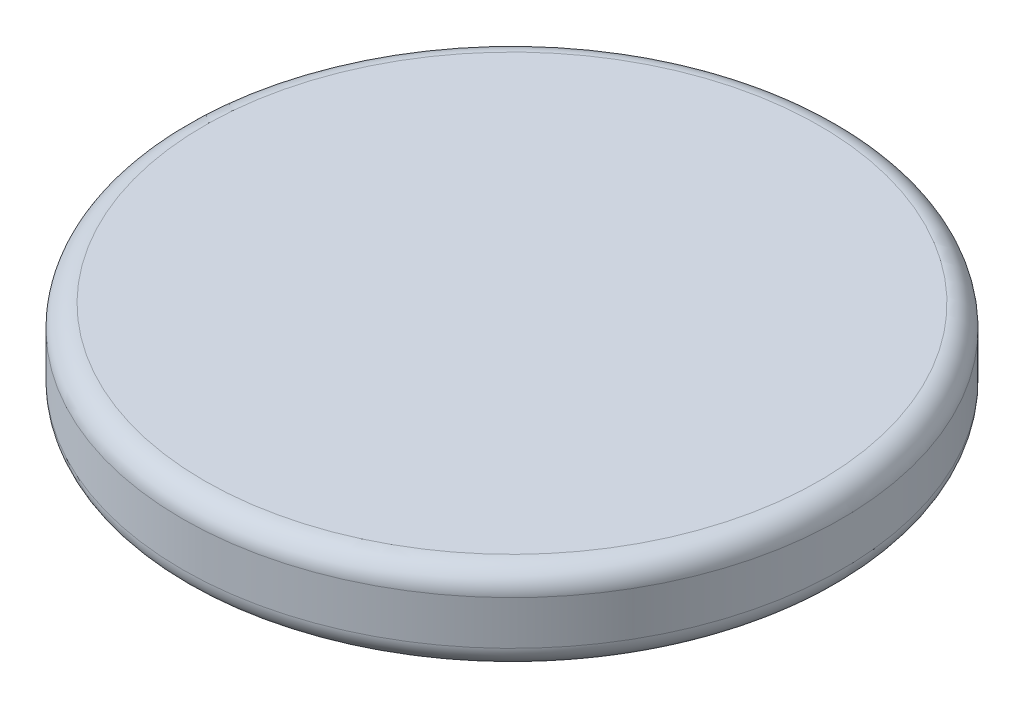
ISO-10303-21;
HEADER;
FILE_DESCRIPTION(('STEP AP214'),'2;1');
FILE_NAME('part.step','',(''),(''),'','','');
FILE_SCHEMA(('AUTOMOTIVE_DESIGN { 1 0 10303 214 1 1 1 1 }'));
ENDSEC;
DATA;
#1=APPLICATION_CONTEXT('core data for automotive mechanical design processes');
#2=APPLICATION_PROTOCOL_DEFINITION('international standard','automotive_design',2000,#1);
#3=PRODUCT_CONTEXT('',#1,'mechanical');
#4=PRODUCT('Part','Part','',(#3));
#5=PRODUCT_RELATED_PRODUCT_CATEGORY('part','',(#4));
#6=PRODUCT_DEFINITION_FORMATION('','',#4);
#7=PRODUCT_DEFINITION_CONTEXT('part definition',#1,'design');
#8=PRODUCT_DEFINITION('design','',#6,#7);
#9=PRODUCT_DEFINITION_SHAPE('','',#8);
#10=(LENGTH_UNIT() NAMED_UNIT(*) SI_UNIT(.MILLI.,.METRE.));
#11=(NAMED_UNIT(*) PLANE_ANGLE_UNIT() SI_UNIT($,.RADIAN.));
#12=(NAMED_UNIT(*) SI_UNIT($,.STERADIAN.) SOLID_ANGLE_UNIT());
#13=UNCERTAINTY_MEASURE_WITH_UNIT(LENGTH_MEASURE(1.E-05),#10,'distance_accuracy_value','');
#14=(GEOMETRIC_REPRESENTATION_CONTEXT(3) GLOBAL_UNCERTAINTY_ASSIGNED_CONTEXT((#13)) GLOBAL_UNIT_ASSIGNED_CONTEXT((#10,
#11,#12)) REPRESENTATION_CONTEXT('',''));
#15=CARTESIAN_POINT('',(0.,0.,0.));
#16=DIRECTION('',(0.,0.,1.));
#17=DIRECTION('',(1.,0.,0.));
#18=AXIS2_PLACEMENT_3D('',#15,#16,#17);
#19=CARTESIAN_POINT('',(0.,2.,0.));
#20=DIRECTION('',(0.,-1.,0.));
#21=DIRECTION('',(0.,0.,-1.));
#22=AXIS2_PLACEMENT_3D('',#19,#20,#21);
#23=CYLINDRICAL_SURFACE('',#22,7.5);
#24=CARTESIAN_POINT('',(0.,0.5,0.));
#25=DIRECTION('',(0.,1.,0.));
#26=DIRECTION('',(0.,0.,1.));
#27=AXIS2_PLACEMENT_3D('',#24,#25,#26);
#28=CIRCLE('',#27,7.5);
#29=CARTESIAN_POINT('',(0.,0.5,7.5));
#30=VERTEX_POINT('',#29);
#31=EDGE_CURVE('E43',#30,#30,#28,.T.);
#32=ORIENTED_EDGE('',*,*,#31,.T.);
#33=EDGE_LOOP('',(#32));
#34=FACE_BOUND('',#33,.T.);
#35=CARTESIAN_POINT('',(0.,1.5,0.));
#36=DIRECTION('',(0.,1.,0.));
#37=DIRECTION('',(0.,0.,1.));
#38=AXIS2_PLACEMENT_3D('',#35,#36,#37);
#39=CIRCLE('',#38,7.5);
#40=CARTESIAN_POINT('',(0.,1.5,7.5));
#41=VERTEX_POINT('',#40);
#42=EDGE_CURVE('E47',#41,#41,#39,.F.);
#43=ORIENTED_EDGE('',*,*,#42,.T.);
#44=EDGE_LOOP('',(#43));
#45=FACE_BOUND('',#44,.T.);
#46=ADVANCED_FACE('F32',(#34,#45),#23,.T.);
#47=CARTESIAN_POINT('',(0.,2.,0.));
#48=DIRECTION('',(0.,1.,0.));
#49=DIRECTION('',(0.,0.,1.));
#50=AXIS2_PLACEMENT_3D('',#47,#48,#49);
#51=PLANE('',#50);
#52=CARTESIAN_POINT('',(0.,2.,0.));
#53=DIRECTION('',(0.,1.,0.));
#54=DIRECTION('',(0.,0.,1.));
#55=AXIS2_PLACEMENT_3D('',#52,#53,#54);
#56=CIRCLE('',#55,7.);
#57=CARTESIAN_POINT('',(0.,2.,7.));
#58=VERTEX_POINT('',#57);
#59=EDGE_CURVE('E10',#58,#58,#56,.T.);
#60=ORIENTED_EDGE('',*,*,#59,.T.);
#61=EDGE_LOOP('',(#60));
#62=FACE_BOUND('',#61,.T.);
#63=ADVANCED_FACE('F63',(#62),#51,.T.);
#64=CARTESIAN_POINT('',(0.,0.,0.));
#65=DIRECTION('',(0.,1.,0.));
#66=DIRECTION('',(0.,0.,1.));
#67=AXIS2_PLACEMENT_3D('',#64,#65,#66);
#68=PLANE('',#67);
#69=CARTESIAN_POINT('',(0.,0.,0.));
#70=DIRECTION('',(0.,1.,0.));
#71=DIRECTION('',(0.,0.,1.));
#72=AXIS2_PLACEMENT_3D('',#69,#70,#71);
#73=CIRCLE('',#72,7.);
#74=CARTESIAN_POINT('',(0.,0.,7.));
#75=VERTEX_POINT('',#74);
#76=EDGE_CURVE('E39',#75,#75,#73,.F.);
#77=ORIENTED_EDGE('',*,*,#76,.T.);
#78=EDGE_LOOP('',(#77));
#79=FACE_BOUND('',#78,.T.);
#80=ADVANCED_FACE('F60',(#79),#68,.F.);
#81=CARTESIAN_POINT('',(0.,0.5,0.));
#82=DIRECTION('',(0.,1.,0.));
#83=DIRECTION('',(0.,0.,1.));
#84=AXIS2_PLACEMENT_3D('',#81,#82,#83);
#85=TOROIDAL_SURFACE('',#84,7.,0.5);
#86=ORIENTED_EDGE('',*,*,#76,.F.);
#87=EDGE_LOOP('',(#86));
#88=FACE_BOUND('',#87,.T.);
#89=ORIENTED_EDGE('',*,*,#31,.F.);
#90=EDGE_LOOP('',(#89));
#91=FACE_BOUND('',#90,.T.);
#92=ADVANCED_FACE('F56',(#88,#91),#85,.T.);
#93=CARTESIAN_POINT('',(0.,1.5,0.));
#94=DIRECTION('',(0.,1.,0.));
#95=DIRECTION('',(0.,0.,1.));
#96=AXIS2_PLACEMENT_3D('',#93,#94,#95);
#97=TOROIDAL_SURFACE('',#96,7.,0.5);
#98=ORIENTED_EDGE('',*,*,#42,.F.);
#99=EDGE_LOOP('',(#98));
#100=FACE_BOUND('',#99,.T.);
#101=ORIENTED_EDGE('',*,*,#59,.F.);
#102=EDGE_LOOP('',(#101));
#103=FACE_BOUND('',#102,.T.);
#104=ADVANCED_FACE('F34',(#100,#103),#97,.T.);
#105=CLOSED_SHELL('',(#46,#63,#80,#92,#104));
#106=MANIFOLD_SOLID_BREP('B2',#105);
#107=ADVANCED_BREP_SHAPE_REPRESENTATION('',(#18,#106),#14);
#108=SHAPE_DEFINITION_REPRESENTATION(#9,#107);
ENDSEC;
END-ISO-10303-21;
